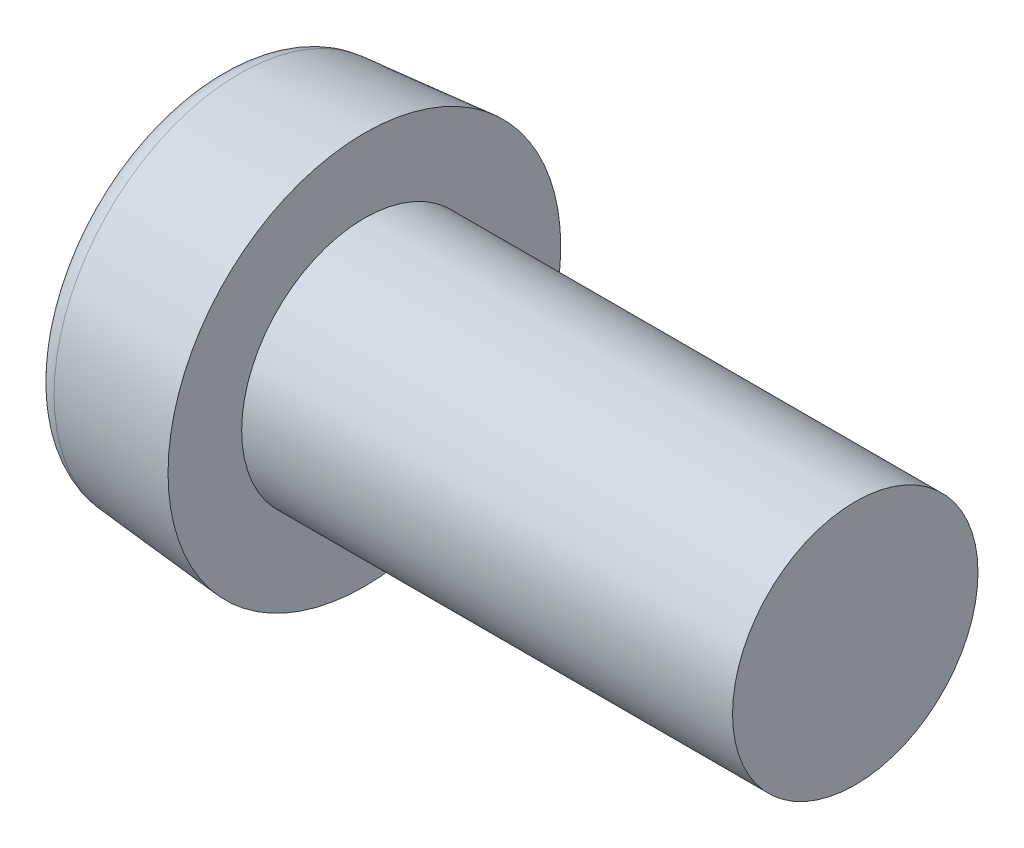
ISO-10303-21;
HEADER;
FILE_DESCRIPTION(('STEP AP214'),'2;1');
FILE_NAME('part.step','',(''),(''),'','','');
FILE_SCHEMA(('AUTOMOTIVE_DESIGN { 1 0 10303 214 1 1 1 1 }'));
ENDSEC;
DATA;
#1=APPLICATION_CONTEXT('core data for automotive mechanical design processes');
#2=APPLICATION_PROTOCOL_DEFINITION('international standard','automotive_design',2000,#1);
#3=PRODUCT_CONTEXT('',#1,'mechanical');
#4=PRODUCT('Part','Part','',(#3));
#5=PRODUCT_RELATED_PRODUCT_CATEGORY('part','',(#4));
#6=PRODUCT_DEFINITION_FORMATION('','',#4);
#7=PRODUCT_DEFINITION_CONTEXT('part definition',#1,'design');
#8=PRODUCT_DEFINITION('design','',#6,#7);
#9=PRODUCT_DEFINITION_SHAPE('','',#8);
#10=(LENGTH_UNIT() NAMED_UNIT(*) SI_UNIT(.MILLI.,.METRE.));
#11=(NAMED_UNIT(*) PLANE_ANGLE_UNIT() SI_UNIT($,.RADIAN.));
#12=(NAMED_UNIT(*) SI_UNIT($,.STERADIAN.) SOLID_ANGLE_UNIT());
#13=UNCERTAINTY_MEASURE_WITH_UNIT(LENGTH_MEASURE(1.E-05),#10,'distance_accuracy_value','');
#14=(GEOMETRIC_REPRESENTATION_CONTEXT(3) GLOBAL_UNCERTAINTY_ASSIGNED_CONTEXT((#13)) GLOBAL_UNIT_ASSIGNED_CONTEXT((#10,
#11,#12)) REPRESENTATION_CONTEXT('',''));
#15=CARTESIAN_POINT('',(0.,0.,0.));
#16=DIRECTION('',(0.,0.,1.));
#17=DIRECTION('',(1.,0.,0.));
#18=AXIS2_PLACEMENT_3D('',#15,#16,#17);
#19=CARTESIAN_POINT('',(0.,0.,0.));
#20=DIRECTION('',(1.,0.,0.));
#21=DIRECTION('',(0.,0.,-1.));
#22=AXIS2_PLACEMENT_3D('',#19,#20,#21);
#23=PLANE('',#22);
#24=CARTESIAN_POINT('',(0.,0.,0.));
#25=DIRECTION('',(1.,0.,0.));
#26=DIRECTION('',(0.,0.,-1.));
#27=AXIS2_PLACEMENT_3D('',#24,#25,#26);
#28=CIRCLE('',#27,6.55873684482703);
#29=CARTESIAN_POINT('',(0.,0.,-6.55873684482703));
#30=VERTEX_POINT('',#29);
#31=EDGE_CURVE('E12',#30,#30,#28,.F.);
#32=ORIENTED_EDGE('',*,*,#31,.T.);
#33=EDGE_LOOP('',(#32));
#34=FACE_BOUND('',#33,.T.);
#35=CARTESIAN_POINT('',(0.,2.86654408652649,-1.655));
#36=CARTESIAN_POINT('',(0.,3.23404973864527,-1.01846153846154));
#37=CARTESIAN_POINT('',(0.,4.41006782542537,0.));
#38=CARTESIAN_POINT('',(0.,2.64604069525522,1.52769230769231));
#39=CARTESIAN_POINT('',(0.,2.20503391271269,3.81923076923077));
#40=CARTESIAN_POINT('',(0.,0.,3.05538461538461));
#41=CARTESIAN_POINT('',(0.,-2.20503391271268,3.81923076923077));
#42=CARTESIAN_POINT('',(0.,-2.64604069525522,1.52769230769231));
#43=CARTESIAN_POINT('',(0.,-4.41006782542537,0.));
#44=CARTESIAN_POINT('',(0.,-2.64604069525522,-1.52769230769231));
#45=CARTESIAN_POINT('',(0.,-2.20503391271269,-3.81923076923077));
#46=CARTESIAN_POINT('',(0.,0.,-3.05538461538461));
#47=CARTESIAN_POINT('',(0.,2.20503391271269,-3.81923076923077));
#48=CARTESIAN_POINT('',(0.,2.49903843440771,-2.29153846153846));
#49=CARTESIAN_POINT('',(0.,2.86654408652649,-1.655));
#50=B_SPLINE_CURVE_WITH_KNOTS('',3,(#35,#36,#37,#38,#39,#40,#41,#42,#43,#44,#45,#46,#47,#48,
#49),.UNSPECIFIED.,.T.,.F.,(4,1,1,1,1,1,1,1,1,1,1,1,4),(0.,0.0833333333333333,0.166666666666667,
0.25,0.333333333333333,0.416666666666667,0.5,0.583333333333333,0.666666666666667,0.75,
0.833333333333333,0.916666666666667,1.),.UNSPECIFIED.);
#51=CARTESIAN_POINT('',(0.,2.86654408652649,-1.655));
#52=VERTEX_POINT('',#51);
#53=EDGE_CURVE('E62',#52,#52,#50,.T.);
#54=ORIENTED_EDGE('',*,*,#53,.T.);
#55=EDGE_LOOP('',(#54));
#56=FACE_BOUND('',#55,.T.);
#57=ADVANCED_FACE('F43',(#34,#56),#23,.F.);
#58=CARTESIAN_POINT('',(6.,0.,0.));
#59=DIRECTION('',(1.,0.,0.));
#60=DIRECTION('',(0.,0.,-1.));
#61=AXIS2_PLACEMENT_3D('',#58,#59,#60);
#62=PLANE('',#61);
#63=CARTESIAN_POINT('',(6.,0.,0.));
#64=DIRECTION('',(1.,0.,0.));
#65=DIRECTION('',(0.,0.,-1.));
#66=AXIS2_PLACEMENT_3D('',#63,#64,#65);
#67=CIRCLE('',#66,8.);
#68=CARTESIAN_POINT('',(6.,0.,-8.));
#69=VERTEX_POINT('',#68);
#70=EDGE_CURVE('E111',#69,#69,#67,.T.);
#71=ORIENTED_EDGE('',*,*,#70,.T.);
#72=EDGE_LOOP('',(#71));
#73=FACE_BOUND('',#72,.T.);
#74=CARTESIAN_POINT('',(6.,0.,0.));
#75=DIRECTION('',(-1.,0.,0.));
#76=DIRECTION('',(0.,0.,1.));
#77=AXIS2_PLACEMENT_3D('',#74,#75,#76);
#78=CIRCLE('',#77,5.);
#79=CARTESIAN_POINT('',(6.,0.,5.));
#80=VERTEX_POINT('',#79);
#81=EDGE_CURVE('E65',#80,#80,#78,.T.);
#82=ORIENTED_EDGE('',*,*,#81,.T.);
#83=EDGE_LOOP('',(#82));
#84=FACE_BOUND('',#83,.T.);
#85=ADVANCED_FACE('F98',(#73,#84),#62,.T.);
#86=CARTESIAN_POINT('',(6.,0.,0.));
#87=DIRECTION('',(1.,0.,0.));
#88=DIRECTION('',(0.,0.,-1.));
#89=AXIS2_PLACEMENT_3D('',#86,#87,#88);
#90=CONICAL_SURFACE('',#89,8.,0.0872664625997167);
#91=CARTESIAN_POINT('',(0.912844257252342,0.,0.));
#92=DIRECTION('',(1.,0.,0.));
#93=DIRECTION('',(0.,0.,-1.));
#94=AXIS2_PLACEMENT_3D('',#91,#92,#93);
#95=CIRCLE('',#94,7.55493154291878);
#96=CARTESIAN_POINT('',(0.912844257252342,0.,-7.55493154291878));
#97=VERTEX_POINT('',#96);
#98=EDGE_CURVE('E50',#97,#97,#95,.T.);
#99=ORIENTED_EDGE('',*,*,#98,.T.);
#100=EDGE_LOOP('',(#99));
#101=FACE_BOUND('',#100,.T.);
#102=ORIENTED_EDGE('',*,*,#70,.F.);
#103=EDGE_LOOP('',(#102));
#104=FACE_BOUND('',#103,.T.);
#105=ADVANCED_FACE('F94',(#101,#104),#90,.T.);
#106=CARTESIAN_POINT('',(26.,5.,0.));
#107=DIRECTION('',(-1.,0.,0.));
#108=DIRECTION('',(0.,0.,1.));
#109=AXIS2_PLACEMENT_3D('',#106,#107,#108);
#110=PLANE('',#109);
#111=CARTESIAN_POINT('',(26.,0.,0.));
#112=DIRECTION('',(-1.,0.,0.));
#113=DIRECTION('',(0.,0.,1.));
#114=AXIS2_PLACEMENT_3D('',#111,#112,#113);
#115=CIRCLE('',#114,5.);
#116=CARTESIAN_POINT('',(26.,0.,5.));
#117=VERTEX_POINT('',#116);
#118=EDGE_CURVE('E113',#117,#117,#115,.T.);
#119=ORIENTED_EDGE('',*,*,#118,.F.);
#120=EDGE_LOOP('',(#119));
#121=FACE_BOUND('',#120,.T.);
#122=ADVANCED_FACE('F90',(#121),#110,.F.);
#123=CARTESIAN_POINT('',(0.,0.,0.));
#124=DIRECTION('',(-1.,0.,0.));
#125=DIRECTION('',(0.,0.,1.));
#126=AXIS2_PLACEMENT_3D('',#123,#124,#125);
#127=CYLINDRICAL_SURFACE('',#126,5.);
#128=ORIENTED_EDGE('',*,*,#81,.F.);
#129=EDGE_LOOP('',(#128));
#130=FACE_BOUND('',#129,.T.);
#131=ORIENTED_EDGE('',*,*,#118,.T.);
#132=EDGE_LOOP('',(#131));
#133=FACE_BOUND('',#132,.T.);
#134=ADVANCED_FACE('F85',(#130,#133),#127,.T.);
#135=CARTESIAN_POINT('',(3.,2.86654408652649,-1.655));
#136=CARTESIAN_POINT('',(3.,3.23404973864527,-1.01846153846154));
#137=CARTESIAN_POINT('',(3.,4.41006782542537,0.));
#138=CARTESIAN_POINT('',(3.,2.64604069525522,1.52769230769231));
#139=CARTESIAN_POINT('',(3.,2.20503391271269,3.81923076923077));
#140=CARTESIAN_POINT('',(3.,0.,3.05538461538461));
#141=CARTESIAN_POINT('',(3.,-2.20503391271268,3.81923076923077));
#142=CARTESIAN_POINT('',(3.,-2.64604069525522,1.52769230769231));
#143=CARTESIAN_POINT('',(3.,-4.41006782542537,0.));
#144=CARTESIAN_POINT('',(3.,-2.64604069525522,-1.52769230769231));
#145=CARTESIAN_POINT('',(3.,-2.20503391271269,-3.81923076923077));
#146=CARTESIAN_POINT('',(3.,0.,-3.05538461538461));
#147=CARTESIAN_POINT('',(3.,2.20503391271269,-3.81923076923077));
#148=CARTESIAN_POINT('',(3.,2.49903843440771,-2.29153846153846));
#149=CARTESIAN_POINT('',(3.,2.86654408652649,-1.655));
#150=B_SPLINE_CURVE_WITH_KNOTS('',3,(#135,#136,#137,#138,#139,#140,#141,#142,#143,#144,#145,
#146,#147,#148,#149),.UNSPECIFIED.,.T.,.F.,(4,1,1,1,1,1,1,1,1,1,1,1,4),(0.,0.0833333333333333,
0.166666666666667,0.25,0.333333333333333,0.416666666666667,0.5,0.583333333333333,
0.666666666666667,0.75,0.833333333333333,0.916666666666667,1.),.UNSPECIFIED.);
#151=DIRECTION('',(-1.,0.,0.));
#152=VECTOR('',#151,1.);
#153=SURFACE_OF_LINEAR_EXTRUSION('',#150,#152);
#154=CARTESIAN_POINT('',(3.,2.86654408652649,-1.655));
#155=CARTESIAN_POINT('',(3.,2.49903843440771,-2.29153846153846));
#156=CARTESIAN_POINT('',(3.,2.20503391271269,-3.81923076923077));
#157=CARTESIAN_POINT('',(3.,0.,-3.05538461538461));
#158=CARTESIAN_POINT('',(3.,-2.20503391271269,-3.81923076923077));
#159=CARTESIAN_POINT('',(3.,-2.64604069525522,-1.52769230769231));
#160=CARTESIAN_POINT('',(3.,-4.41006782542537,0.));
#161=CARTESIAN_POINT('',(3.,-2.64604069525522,1.52769230769231));
#162=CARTESIAN_POINT('',(3.,-2.20503391271268,3.81923076923077));
#163=CARTESIAN_POINT('',(3.,0.,3.05538461538461));
#164=CARTESIAN_POINT('',(3.,2.20503391271269,3.81923076923077));
#165=CARTESIAN_POINT('',(3.,2.64604069525522,1.52769230769231));
#166=CARTESIAN_POINT('',(3.,4.41006782542537,0.));
#167=CARTESIAN_POINT('',(3.,3.23404973864527,-1.01846153846154));
#168=CARTESIAN_POINT('',(3.,2.86654408652649,-1.655));
#169=B_SPLINE_CURVE_WITH_KNOTS('',3,(#154,#155,#156,#157,#158,#159,#160,#161,#162,#163,#164,
#165,#166,#167,#168),.UNSPECIFIED.,.T.,.F.,(4,1,1,1,1,1,1,1,1,1,1,1,4),(0.,0.0833333333333334,
0.166666666666667,0.25,0.333333333333333,0.416666666666667,0.5,0.583333333333333,
0.666666666666667,0.75,0.833333333333333,0.916666666666667,1.),.UNSPECIFIED.);
#170=CARTESIAN_POINT('',(3.,2.86654408652649,-1.655));
#171=VERTEX_POINT('',#170);
#172=EDGE_CURVE('E60',#171,#171,#169,.T.);
#173=ORIENTED_EDGE('',*,*,#172,.F.);
#174=EDGE_LOOP('',(#173));
#175=FACE_BOUND('',#174,.T.);
#176=ORIENTED_EDGE('',*,*,#53,.F.);
#177=EDGE_LOOP('',(#176));
#178=FACE_BOUND('',#177,.T.);
#179=ADVANCED_FACE('F56',(#175,#178),#153,.T.);
#180=CARTESIAN_POINT('',(4.,0.,0.));
#181=CARTESIAN_POINT('',(3.,2.86654408652649,-1.655));
#182=CARTESIAN_POINT('',(4.,0.,0.));
#183=CARTESIAN_POINT('',(3.,2.49903843440771,-2.29153846153846));
#184=CARTESIAN_POINT('',(4.,0.,0.));
#185=CARTESIAN_POINT('',(3.,2.20503391271269,-3.81923076923077));
#186=CARTESIAN_POINT('',(4.,0.,0.));
#187=CARTESIAN_POINT('',(3.,0.,-3.05538461538461));
#188=CARTESIAN_POINT('',(4.,0.,0.));
#189=CARTESIAN_POINT('',(3.,-2.20503391271269,-3.81923076923077));
#190=CARTESIAN_POINT('',(4.,0.,0.));
#191=CARTESIAN_POINT('',(3.,-2.64604069525522,-1.52769230769231));
#192=CARTESIAN_POINT('',(4.,0.,0.));
#193=CARTESIAN_POINT('',(3.,-4.41006782542537,0.));
#194=CARTESIAN_POINT('',(4.,0.,0.));
#195=CARTESIAN_POINT('',(3.,-2.64604069525522,1.52769230769231));
#196=CARTESIAN_POINT('',(4.,0.,0.));
#197=CARTESIAN_POINT('',(3.,-2.20503391271268,3.81923076923077));
#198=CARTESIAN_POINT('',(4.,0.,0.));
#199=CARTESIAN_POINT('',(3.,0.,3.05538461538461));
#200=CARTESIAN_POINT('',(4.,0.,0.));
#201=CARTESIAN_POINT('',(3.,2.20503391271269,3.81923076923077));
#202=CARTESIAN_POINT('',(4.,0.,0.));
#203=CARTESIAN_POINT('',(3.,2.64604069525522,1.52769230769231));
#204=CARTESIAN_POINT('',(4.,0.,0.));
#205=CARTESIAN_POINT('',(3.,4.41006782542537,0.));
#206=CARTESIAN_POINT('',(4.,0.,0.));
#207=CARTESIAN_POINT('',(3.,3.23404973864527,-1.01846153846154));
#208=CARTESIAN_POINT('',(4.,0.,0.));
#209=CARTESIAN_POINT('',(3.,2.86654408652649,-1.655));
#210=B_SPLINE_SURFACE_WITH_KNOTS('',3,1,((#180,#181),(#182,#183),(#184,#185),(#186,#187),(#188,
#189),(#190,#191),(#192,#193),(#194,#195),(#196,#197),(#198,#199),(#200,#201),(#202,#203),(#204,
#205),(#206,#207),(#208,#209)),.UNSPECIFIED.,.T.,.F.,.F.,(4,1,1,1,1,1,1,1,1,1,1,1,4),(2,2),(0.,
0.0833333333333334,0.166666666666667,0.25,0.333333333333333,0.416666666666667,0.5,
0.583333333333333,0.666666666666667,0.75,0.833333333333333,0.916666666666667,1.),(0.,1.),.UNSPECIFIED.);
#211=CARTESIAN_POINT('',(4.,0.,0.));
#212=VERTEX_POINT('',#211);
#213=VERTEX_LOOP('',#212);
#214=FACE_BOUND('',#213,.T.);
#215=ORIENTED_EDGE('',*,*,#172,.T.);
#216=EDGE_LOOP('',(#215));
#217=FACE_BOUND('',#216,.T.);
#218=ADVANCED_FACE('F53',(#214,#217),#210,.F.);
#219=CARTESIAN_POINT('',(1.,0.,0.));
#220=DIRECTION('',(1.,0.,0.));
#221=DIRECTION('',(0.,0.,-1.));
#222=AXIS2_PLACEMENT_3D('',#219,#220,#221);
#223=TOROIDAL_SURFACE('',#222,6.55873684482703,1.);
#224=ORIENTED_EDGE('',*,*,#31,.F.);
#225=EDGE_LOOP('',(#224));
#226=FACE_BOUND('',#225,.T.);
#227=ORIENTED_EDGE('',*,*,#98,.F.);
#228=EDGE_LOOP('',(#227));
#229=FACE_BOUND('',#228,.T.);
#230=ADVANCED_FACE('F45',(#226,#229),#223,.T.);
#231=CLOSED_SHELL('',(#57,#85,#105,#122,#134,#179,#218,#230));
#232=MANIFOLD_SOLID_BREP('B2',#231);
#233=ADVANCED_BREP_SHAPE_REPRESENTATION('',(#18,#232),#14);
#234=SHAPE_DEFINITION_REPRESENTATION(#9,#233);
ENDSEC;
END-ISO-10303-21;
